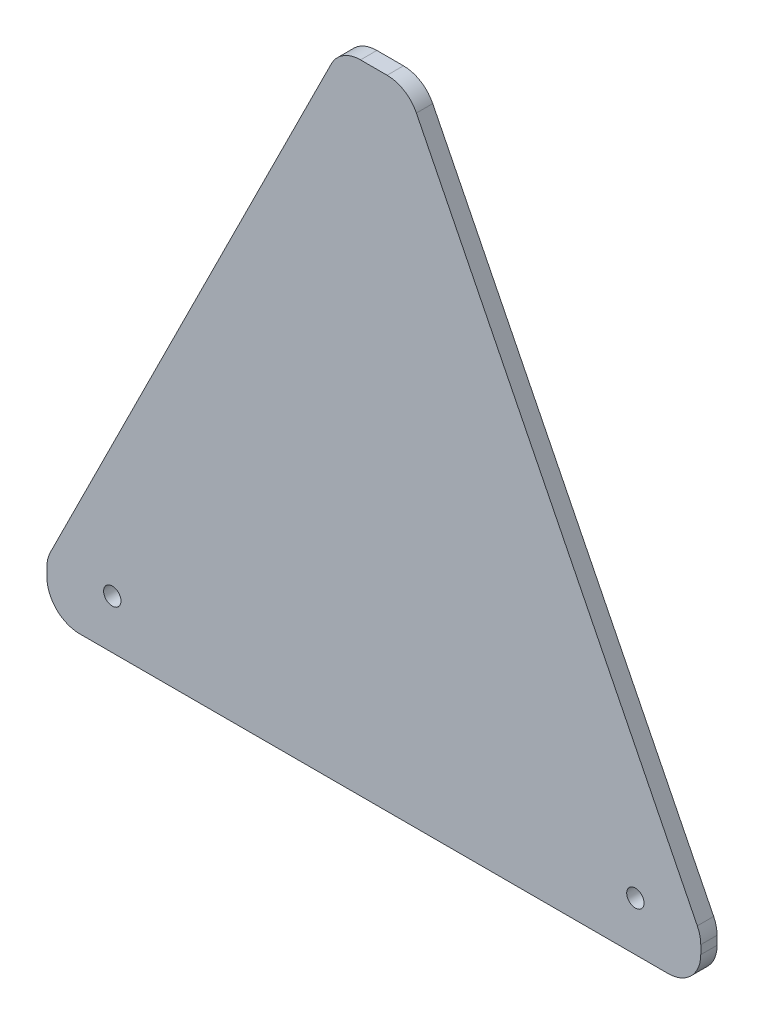
ISO-10303-21;
HEADER;
FILE_DESCRIPTION(('STEP AP214'),'2;1');
FILE_NAME('part.step','',(''),(''),'','','');
FILE_SCHEMA(('AUTOMOTIVE_DESIGN { 1 0 10303 214 1 1 1 1 }'));
ENDSEC;
DATA;
#1=APPLICATION_CONTEXT('core data for automotive mechanical design processes');
#2=APPLICATION_PROTOCOL_DEFINITION('international standard','automotive_design',2000,#1);
#3=PRODUCT_CONTEXT('',#1,'mechanical');
#4=PRODUCT('Part','Part','',(#3));
#5=PRODUCT_RELATED_PRODUCT_CATEGORY('part','',(#4));
#6=PRODUCT_DEFINITION_FORMATION('','',#4);
#7=PRODUCT_DEFINITION_CONTEXT('part definition',#1,'design');
#8=PRODUCT_DEFINITION('design','',#6,#7);
#9=PRODUCT_DEFINITION_SHAPE('','',#8);
#10=(LENGTH_UNIT() NAMED_UNIT(*) SI_UNIT(.MILLI.,.METRE.));
#11=(NAMED_UNIT(*) PLANE_ANGLE_UNIT() SI_UNIT($,.RADIAN.));
#12=(NAMED_UNIT(*) SI_UNIT($,.STERADIAN.) SOLID_ANGLE_UNIT());
#13=UNCERTAINTY_MEASURE_WITH_UNIT(LENGTH_MEASURE(1.E-05),#10,'distance_accuracy_value','');
#14=(GEOMETRIC_REPRESENTATION_CONTEXT(3) GLOBAL_UNCERTAINTY_ASSIGNED_CONTEXT((#13)) GLOBAL_UNIT_ASSIGNED_CONTEXT((#10,
#11,#12)) REPRESENTATION_CONTEXT('',''));
#15=CARTESIAN_POINT('',(0.,0.,0.));
#16=DIRECTION('',(0.,0.,1.));
#17=DIRECTION('',(1.,0.,0.));
#18=AXIS2_PLACEMENT_3D('',#15,#16,#17);
#19=CARTESIAN_POINT('',(0.,0.,6.35));
#20=DIRECTION('',(0.,0.,-1.));
#21=DIRECTION('',(-1.,0.,0.));
#22=AXIS2_PLACEMENT_3D('',#19,#20,#21);
#23=PLANE('',#22);
#24=DIRECTION('',(-1.,0.,0.));
#25=VECTOR('',#24,1.);
#26=CARTESIAN_POINT('',(113.975755601014,247.65,6.35));
#27=LINE('',#26,#25);
#28=CARTESIAN_POINT('',(132.165245934657,247.65,6.35));
#29=VERTEX_POINT('',#28);
#30=CARTESIAN_POINT('',(121.834754065343,247.65,6.35));
#31=VERTEX_POINT('',#30);
#32=EDGE_CURVE('E231',#29,#31,#27,.T.);
#33=ORIENTED_EDGE('',*,*,#32,.T.);
#34=CARTESIAN_POINT('',(121.834754065343,234.95,6.35));
#35=DIRECTION('',(0.,0.,-1.));
#36=DIRECTION('',(-1.,0.,0.));
#37=AXIS2_PLACEMENT_3D('',#34,#35,#36);
#38=CIRCLE('',#37,12.7);
#39=CARTESIAN_POINT('',(110.469087672997,240.616712226495,6.35));
#40=VERTEX_POINT('',#39);
#41=EDGE_CURVE('E182',#31,#40,#38,.F.);
#42=ORIENTED_EDGE('',*,*,#41,.T.);
#43=DIRECTION('',(-0.446197813109806,-0.894934361602026,0.));
#44=VECTOR('',#43,1.);
#45=CARTESIAN_POINT('',(0.,19.05,6.35));
#46=LINE('',#45,#44);
#47=CARTESIAN_POINT('',(1.33433360765427,21.7262591842563,6.35));
#48=VERTEX_POINT('',#47);
#49=EDGE_CURVE('E144',#40,#48,#46,.T.);
#50=ORIENTED_EDGE('',*,*,#49,.T.);
#51=CARTESIAN_POINT('',(12.7,16.0595469577618,6.35));
#52=DIRECTION('',(0.,0.,-1.));
#53=DIRECTION('',(-1.,0.,0.));
#54=AXIS2_PLACEMENT_3D('',#51,#52,#53);
#55=CIRCLE('',#54,12.7);
#56=CARTESIAN_POINT('',(0.,16.0595469577618,6.35));
#57=VERTEX_POINT('',#56);
#58=EDGE_CURVE('E173',#48,#57,#55,.F.);
#59=ORIENTED_EDGE('',*,*,#58,.T.);
#60=DIRECTION('',(0.,-1.,0.));
#61=VECTOR('',#60,1.);
#62=CARTESIAN_POINT('',(0.,0.,6.35));
#63=LINE('',#62,#61);
#64=CARTESIAN_POINT('',(0.,12.7,6.35));
#65=VERTEX_POINT('',#64);
#66=EDGE_CURVE('E151',#57,#65,#63,.T.);
#67=ORIENTED_EDGE('',*,*,#66,.T.);
#68=CARTESIAN_POINT('',(12.7,12.7,6.35));
#69=DIRECTION('',(0.,0.,-1.));
#70=DIRECTION('',(-1.,0.,0.));
#71=AXIS2_PLACEMENT_3D('',#68,#69,#70);
#72=CIRCLE('',#71,12.7);
#73=CARTESIAN_POINT('',(12.7,0.,6.35));
#74=VERTEX_POINT('',#73);
#75=EDGE_CURVE('E175',#65,#74,#72,.F.);
#76=ORIENTED_EDGE('',*,*,#75,.T.);
#77=DIRECTION('',(1.,0.,0.));
#78=VECTOR('',#77,1.);
#79=CARTESIAN_POINT('',(0.,0.,6.35));
#80=LINE('',#79,#78);
#81=CARTESIAN_POINT('',(241.3,0.,6.35));
#82=VERTEX_POINT('',#81);
#83=EDGE_CURVE('E155',#74,#82,#80,.T.);
#84=ORIENTED_EDGE('',*,*,#83,.T.);
#85=CARTESIAN_POINT('',(241.3,12.7,6.35));
#86=DIRECTION('',(0.,0.,-1.));
#87=DIRECTION('',(-1.,0.,0.));
#88=AXIS2_PLACEMENT_3D('',#85,#86,#87);
#89=CIRCLE('',#88,12.7);
#90=CARTESIAN_POINT('',(254.,12.7,6.35));
#91=VERTEX_POINT('',#90);
#92=EDGE_CURVE('E177',#82,#91,#89,.F.);
#93=ORIENTED_EDGE('',*,*,#92,.T.);
#94=DIRECTION('',(0.,1.,0.));
#95=VECTOR('',#94,1.);
#96=CARTESIAN_POINT('',(254.,0.,6.35));
#97=LINE('',#96,#95);
#98=CARTESIAN_POINT('',(254.,16.0595469577617,6.35));
#99=VERTEX_POINT('',#98);
#100=EDGE_CURVE('E235',#91,#99,#97,.T.);
#101=ORIENTED_EDGE('',*,*,#100,.T.);
#102=CARTESIAN_POINT('',(241.3,16.0595469577617,6.35));
#103=DIRECTION('',(0.,0.,-1.));
#104=DIRECTION('',(-1.,0.,0.));
#105=AXIS2_PLACEMENT_3D('',#102,#103,#104);
#106=CIRCLE('',#105,12.7);
#107=CARTESIAN_POINT('',(252.665666392346,21.7262591842563,6.35));
#108=VERTEX_POINT('',#107);
#109=EDGE_CURVE('E56',#99,#108,#106,.F.);
#110=ORIENTED_EDGE('',*,*,#109,.T.);
#111=DIRECTION('',(-0.446197813109806,0.894934361602026,0.));
#112=VECTOR('',#111,1.);
#113=CARTESIAN_POINT('',(140.024244398986,247.65,6.35));
#114=LINE('',#113,#112);
#115=CARTESIAN_POINT('',(143.530912327003,240.616712226495,6.35));
#116=VERTEX_POINT('',#115);
#117=EDGE_CURVE('E232',#108,#116,#114,.T.);
#118=ORIENTED_EDGE('',*,*,#117,.T.);
#119=CARTESIAN_POINT('',(132.165245934657,234.95,6.35));
#120=DIRECTION('',(0.,0.,-1.));
#121=DIRECTION('',(-1.,0.,0.));
#122=AXIS2_PLACEMENT_3D('',#119,#120,#121);
#123=CIRCLE('',#122,12.7);
#124=EDGE_CURVE('E180',#116,#29,#123,.F.);
#125=ORIENTED_EDGE('',*,*,#124,.T.);
#126=EDGE_LOOP('',(#33,#42,#50,#59,#67,#76,#84,#93,#101,#110,#118,#125));
#127=FACE_BOUND('',#126,.T.);
#128=CARTESIAN_POINT('',(25.4,19.05,6.35));
#129=DIRECTION('',(0.,0.,1.));
#130=DIRECTION('',(1.,0.,0.));
#131=AXIS2_PLACEMENT_3D('',#128,#129,#130);
#132=CIRCLE('',#131,3.3734375);
#133=CARTESIAN_POINT('',(28.7734375,19.05,6.35));
#134=VERTEX_POINT('',#133);
#135=EDGE_CURVE('E209',#134,#134,#132,.T.);
#136=ORIENTED_EDGE('',*,*,#135,.F.);
#137=EDGE_LOOP('',(#136));
#138=FACE_BOUND('',#137,.T.);
#139=CARTESIAN_POINT('',(228.6,19.05,6.35));
#140=DIRECTION('',(0.,0.,1.));
#141=DIRECTION('',(1.,0.,0.));
#142=AXIS2_PLACEMENT_3D('',#139,#140,#141);
#143=CIRCLE('',#142,3.37343750000003);
#144=CARTESIAN_POINT('',(231.9734375,19.05,6.35));
#145=VERTEX_POINT('',#144);
#146=EDGE_CURVE('E242',#145,#145,#143,.T.);
#147=ORIENTED_EDGE('',*,*,#146,.F.);
#148=EDGE_LOOP('',(#147));
#149=FACE_BOUND('',#148,.T.);
#150=ADVANCED_FACE('F34',(#127,#138,#149),#23,.F.);
#151=CARTESIAN_POINT('',(0.,0.,0.));
#152=DIRECTION('',(0.,0.,-1.));
#153=DIRECTION('',(-1.,0.,0.));
#154=AXIS2_PLACEMENT_3D('',#151,#152,#153);
#155=PLANE('',#154);
#156=CARTESIAN_POINT('',(25.4,19.05,0.));
#157=DIRECTION('',(0.,0.,1.));
#158=DIRECTION('',(1.,0.,0.));
#159=AXIS2_PLACEMENT_3D('',#156,#157,#158);
#160=CIRCLE('',#159,3.3734375);
#161=CARTESIAN_POINT('',(28.7734375,19.05,0.));
#162=VERTEX_POINT('',#161);
#163=EDGE_CURVE('E215',#162,#162,#160,.T.);
#164=ORIENTED_EDGE('',*,*,#163,.T.);
#165=EDGE_LOOP('',(#164));
#166=FACE_BOUND('',#165,.T.);
#167=DIRECTION('',(-0.446197813109806,-0.894934361602026,0.));
#168=VECTOR('',#167,1.);
#169=CARTESIAN_POINT('',(0.,19.05,0.));
#170=LINE('',#169,#168);
#171=CARTESIAN_POINT('',(110.469087672997,240.616712226495,0.));
#172=VERTEX_POINT('',#171);
#173=CARTESIAN_POINT('',(1.33433360765427,21.7262591842563,0.));
#174=VERTEX_POINT('',#173);
#175=EDGE_CURVE('E141',#172,#174,#170,.T.);
#176=ORIENTED_EDGE('',*,*,#175,.F.);
#177=CARTESIAN_POINT('',(121.834754065343,234.95,0.));
#178=DIRECTION('',(0.,0.,-1.));
#179=DIRECTION('',(-1.,0.,0.));
#180=AXIS2_PLACEMENT_3D('',#177,#178,#179);
#181=CIRCLE('',#180,12.7);
#182=CARTESIAN_POINT('',(121.834754065343,247.65,0.));
#183=VERTEX_POINT('',#182);
#184=EDGE_CURVE('E124',#172,#183,#181,.T.);
#185=ORIENTED_EDGE('',*,*,#184,.T.);
#186=DIRECTION('',(-1.,0.,0.));
#187=VECTOR('',#186,1.);
#188=CARTESIAN_POINT('',(113.975755601014,247.65,0.));
#189=LINE('',#188,#187);
#190=CARTESIAN_POINT('',(132.165245934657,247.65,0.));
#191=VERTEX_POINT('',#190);
#192=EDGE_CURVE('E152',#191,#183,#189,.T.);
#193=ORIENTED_EDGE('',*,*,#192,.F.);
#194=CARTESIAN_POINT('',(132.165245934657,234.95,0.));
#195=DIRECTION('',(0.,0.,-1.));
#196=DIRECTION('',(-1.,0.,0.));
#197=AXIS2_PLACEMENT_3D('',#194,#195,#196);
#198=CIRCLE('',#197,12.7);
#199=CARTESIAN_POINT('',(143.530912327003,240.616712226495,0.));
#200=VERTEX_POINT('',#199);
#201=EDGE_CURVE('E135',#191,#200,#198,.T.);
#202=ORIENTED_EDGE('',*,*,#201,.T.);
#203=DIRECTION('',(-0.446197813109806,0.894934361602026,0.));
#204=VECTOR('',#203,1.);
#205=CARTESIAN_POINT('',(140.024244398986,247.65,0.));
#206=LINE('',#205,#204);
#207=CARTESIAN_POINT('',(252.665666392346,21.7262591842563,0.));
#208=VERTEX_POINT('',#207);
#209=EDGE_CURVE('E157',#208,#200,#206,.T.);
#210=ORIENTED_EDGE('',*,*,#209,.F.);
#211=CARTESIAN_POINT('',(241.3,16.0595469577617,0.));
#212=DIRECTION('',(0.,0.,-1.));
#213=DIRECTION('',(-1.,0.,0.));
#214=AXIS2_PLACEMENT_3D('',#211,#212,#213);
#215=CIRCLE('',#214,12.7);
#216=CARTESIAN_POINT('',(254.,16.0595469577617,0.));
#217=VERTEX_POINT('',#216);
#218=EDGE_CURVE('E167',#208,#217,#215,.T.);
#219=ORIENTED_EDGE('',*,*,#218,.T.);
#220=DIRECTION('',(0.,1.,0.));
#221=VECTOR('',#220,1.);
#222=CARTESIAN_POINT('',(254.,0.,0.));
#223=LINE('',#222,#221);
#224=CARTESIAN_POINT('',(254.,12.7,0.));
#225=VERTEX_POINT('',#224);
#226=EDGE_CURVE('E212',#225,#217,#223,.T.);
#227=ORIENTED_EDGE('',*,*,#226,.F.);
#228=CARTESIAN_POINT('',(241.3,12.7,0.));
#229=DIRECTION('',(0.,0.,-1.));
#230=DIRECTION('',(-1.,0.,0.));
#231=AXIS2_PLACEMENT_3D('',#228,#229,#230);
#232=CIRCLE('',#231,12.7);
#233=CARTESIAN_POINT('',(241.3,0.,0.));
#234=VERTEX_POINT('',#233);
#235=EDGE_CURVE('E165',#225,#234,#232,.T.);
#236=ORIENTED_EDGE('',*,*,#235,.T.);
#237=DIRECTION('',(1.,0.,0.));
#238=VECTOR('',#237,1.);
#239=CARTESIAN_POINT('',(0.,0.,0.));
#240=LINE('',#239,#238);
#241=CARTESIAN_POINT('',(12.7,0.,0.));
#242=VERTEX_POINT('',#241);
#243=EDGE_CURVE('E208',#242,#234,#240,.T.);
#244=ORIENTED_EDGE('',*,*,#243,.F.);
#245=CARTESIAN_POINT('',(12.7,12.7,0.));
#246=DIRECTION('',(0.,0.,-1.));
#247=DIRECTION('',(-1.,0.,0.));
#248=AXIS2_PLACEMENT_3D('',#245,#246,#247);
#249=CIRCLE('',#248,12.7);
#250=CARTESIAN_POINT('',(0.,12.7,0.));
#251=VERTEX_POINT('',#250);
#252=EDGE_CURVE('E163',#242,#251,#249,.T.);
#253=ORIENTED_EDGE('',*,*,#252,.T.);
#254=DIRECTION('',(0.,-1.,0.));
#255=VECTOR('',#254,1.);
#256=CARTESIAN_POINT('',(0.,0.,0.));
#257=LINE('',#256,#255);
#258=CARTESIAN_POINT('',(0.,16.0595469577618,0.));
#259=VERTEX_POINT('',#258);
#260=EDGE_CURVE('E203',#259,#251,#257,.T.);
#261=ORIENTED_EDGE('',*,*,#260,.F.);
#262=CARTESIAN_POINT('',(12.7,16.0595469577618,0.));
#263=DIRECTION('',(0.,0.,-1.));
#264=DIRECTION('',(-1.,0.,0.));
#265=AXIS2_PLACEMENT_3D('',#262,#263,#264);
#266=CIRCLE('',#265,12.7);
#267=EDGE_CURVE('E145',#259,#174,#266,.T.);
#268=ORIENTED_EDGE('',*,*,#267,.T.);
#269=EDGE_LOOP('',(#176,#185,#193,#202,#210,#219,#227,#236,#244,#253,#261,#268));
#270=FACE_BOUND('',#269,.T.);
#271=CARTESIAN_POINT('',(228.6,19.05,0.));
#272=DIRECTION('',(0.,0.,1.));
#273=DIRECTION('',(1.,0.,0.));
#274=AXIS2_PLACEMENT_3D('',#271,#272,#273);
#275=CIRCLE('',#274,3.37343750000003);
#276=CARTESIAN_POINT('',(231.9734375,19.05,0.));
#277=VERTEX_POINT('',#276);
#278=EDGE_CURVE('E244',#277,#277,#275,.T.);
#279=ORIENTED_EDGE('',*,*,#278,.T.);
#280=EDGE_LOOP('',(#279));
#281=FACE_BOUND('',#280,.T.);
#282=ADVANCED_FACE('F148',(#166,#270,#281),#155,.T.);
#283=CARTESIAN_POINT('',(0.,0.,6.35));
#284=DIRECTION('',(1.,0.,0.));
#285=DIRECTION('',(0.,0.,-1.));
#286=AXIS2_PLACEMENT_3D('',#283,#284,#285);
#287=PLANE('',#286);
#288=ORIENTED_EDGE('',*,*,#260,.T.);
#289=DIRECTION('',(0.,0.,-1.));
#290=VECTOR('',#289,1.);
#291=CARTESIAN_POINT('',(0.,12.7,6.35));
#292=LINE('',#291,#290);
#293=EDGE_CURVE('E11',#251,#65,#292,.F.);
#294=ORIENTED_EDGE('',*,*,#293,.T.);
#295=ORIENTED_EDGE('',*,*,#66,.F.);
#296=DIRECTION('',(0.,0.,-1.));
#297=VECTOR('',#296,1.);
#298=CARTESIAN_POINT('',(0.,16.0595469577618,6.35));
#299=LINE('',#298,#297);
#300=EDGE_CURVE('E42',#57,#259,#299,.T.);
#301=ORIENTED_EDGE('',*,*,#300,.T.);
#302=EDGE_LOOP('',(#288,#294,#295,#301));
#303=FACE_BOUND('',#302,.T.);
#304=ADVANCED_FACE('F202',(#303),#287,.F.);
#305=CARTESIAN_POINT('',(0.,0.,6.35));
#306=DIRECTION('',(0.,1.,0.));
#307=DIRECTION('',(0.,0.,1.));
#308=AXIS2_PLACEMENT_3D('',#305,#306,#307);
#309=PLANE('',#308);
#310=ORIENTED_EDGE('',*,*,#243,.T.);
#311=DIRECTION('',(0.,0.,-1.));
#312=VECTOR('',#311,1.);
#313=CARTESIAN_POINT('',(241.3,0.,6.35));
#314=LINE('',#313,#312);
#315=EDGE_CURVE('E196',#234,#82,#314,.F.);
#316=ORIENTED_EDGE('',*,*,#315,.T.);
#317=ORIENTED_EDGE('',*,*,#83,.F.);
#318=DIRECTION('',(0.,0.,-1.));
#319=VECTOR('',#318,1.);
#320=CARTESIAN_POINT('',(12.7,0.,6.35));
#321=LINE('',#320,#319);
#322=EDGE_CURVE('E193',#74,#242,#321,.T.);
#323=ORIENTED_EDGE('',*,*,#322,.T.);
#324=EDGE_LOOP('',(#310,#316,#317,#323));
#325=FACE_BOUND('',#324,.T.);
#326=ADVANCED_FACE('F273',(#325),#309,.F.);
#327=CARTESIAN_POINT('',(254.,0.,6.35));
#328=DIRECTION('',(-1.,0.,0.));
#329=DIRECTION('',(0.,0.,1.));
#330=AXIS2_PLACEMENT_3D('',#327,#328,#329);
#331=PLANE('',#330);
#332=ORIENTED_EDGE('',*,*,#226,.T.);
#333=DIRECTION('',(0.,0.,-1.));
#334=VECTOR('',#333,1.);
#335=CARTESIAN_POINT('',(254.,16.0595469577617,6.35));
#336=LINE('',#335,#334);
#337=EDGE_CURVE('E191',#217,#99,#336,.F.);
#338=ORIENTED_EDGE('',*,*,#337,.T.);
#339=ORIENTED_EDGE('',*,*,#100,.F.);
#340=DIRECTION('',(0.,0.,-1.));
#341=VECTOR('',#340,1.);
#342=CARTESIAN_POINT('',(254.,12.7,6.35));
#343=LINE('',#342,#341);
#344=EDGE_CURVE('E188',#91,#225,#343,.T.);
#345=ORIENTED_EDGE('',*,*,#344,.T.);
#346=EDGE_LOOP('',(#332,#338,#339,#345));
#347=FACE_BOUND('',#346,.T.);
#348=ADVANCED_FACE('F270',(#347),#331,.F.);
#349=CARTESIAN_POINT('',(140.024244398986,247.65,6.35));
#350=DIRECTION('',(-0.894934361602026,-0.446197813109806,0.));
#351=DIRECTION('',(0.446197813109806,-0.894934361602026,0.));
#352=AXIS2_PLACEMENT_3D('',#349,#350,#351);
#353=PLANE('',#352);
#354=ORIENTED_EDGE('',*,*,#209,.T.);
#355=DIRECTION('',(0.,0.,-1.));
#356=VECTOR('',#355,1.);
#357=CARTESIAN_POINT('',(143.530912327003,240.616712226495,6.35));
#358=LINE('',#357,#356);
#359=EDGE_CURVE('E49',#200,#116,#358,.F.);
#360=ORIENTED_EDGE('',*,*,#359,.T.);
#361=ORIENTED_EDGE('',*,*,#117,.F.);
#362=DIRECTION('',(0.,0.,-1.));
#363=VECTOR('',#362,1.);
#364=CARTESIAN_POINT('',(252.665666392346,21.7262591842563,6.35));
#365=LINE('',#364,#363);
#366=EDGE_CURVE('E184',#108,#208,#365,.T.);
#367=ORIENTED_EDGE('',*,*,#366,.T.);
#368=EDGE_LOOP('',(#354,#360,#361,#367));
#369=FACE_BOUND('',#368,.T.);
#370=ADVANCED_FACE('F222',(#369),#353,.F.);
#371=CARTESIAN_POINT('',(113.975755601014,247.65,6.35));
#372=DIRECTION('',(0.,-1.,0.));
#373=DIRECTION('',(0.,0.,-1.));
#374=AXIS2_PLACEMENT_3D('',#371,#372,#373);
#375=PLANE('',#374);
#376=ORIENTED_EDGE('',*,*,#192,.T.);
#377=DIRECTION('',(0.,0.,-1.));
#378=VECTOR('',#377,1.);
#379=CARTESIAN_POINT('',(121.834754065343,247.65,6.35));
#380=LINE('',#379,#378);
#381=EDGE_CURVE('E129',#183,#31,#380,.F.);
#382=ORIENTED_EDGE('',*,*,#381,.T.);
#383=ORIENTED_EDGE('',*,*,#32,.F.);
#384=DIRECTION('',(0.,0.,-1.));
#385=VECTOR('',#384,1.);
#386=CARTESIAN_POINT('',(132.165245934657,247.65,6.35));
#387=LINE('',#386,#385);
#388=EDGE_CURVE('E134',#29,#191,#387,.T.);
#389=ORIENTED_EDGE('',*,*,#388,.T.);
#390=EDGE_LOOP('',(#376,#382,#383,#389));
#391=FACE_BOUND('',#390,.T.);
#392=ADVANCED_FACE('F234',(#391),#375,.F.);
#393=CARTESIAN_POINT('',(0.,19.05,6.35));
#394=DIRECTION('',(0.894934361602026,-0.446197813109806,0.));
#395=DIRECTION('',(0.446197813109806,0.894934361602026,0.));
#396=AXIS2_PLACEMENT_3D('',#393,#394,#395);
#397=PLANE('',#396);
#398=ORIENTED_EDGE('',*,*,#49,.F.);
#399=DIRECTION('',(0.,0.,-1.));
#400=VECTOR('',#399,1.);
#401=CARTESIAN_POINT('',(110.469087672997,240.616712226495,6.35));
#402=LINE('',#401,#400);
#403=EDGE_CURVE('E128',#40,#172,#402,.T.);
#404=ORIENTED_EDGE('',*,*,#403,.T.);
#405=ORIENTED_EDGE('',*,*,#175,.T.);
#406=DIRECTION('',(0.,0.,-1.));
#407=VECTOR('',#406,1.);
#408=CARTESIAN_POINT('',(1.33433360765427,21.7262591842563,6.35));
#409=LINE('',#408,#407);
#410=EDGE_CURVE('E146',#174,#48,#409,.F.);
#411=ORIENTED_EDGE('',*,*,#410,.T.);
#412=EDGE_LOOP('',(#398,#404,#405,#411));
#413=FACE_BOUND('',#412,.T.);
#414=ADVANCED_FACE('F140',(#413),#397,.F.);
#415=CARTESIAN_POINT('',(25.4,19.05,6.35));
#416=DIRECTION('',(0.,0.,-1.));
#417=DIRECTION('',(-1.,0.,0.));
#418=AXIS2_PLACEMENT_3D('',#415,#416,#417);
#419=CYLINDRICAL_SURFACE('',#418,3.3734375);
#420=ORIENTED_EDGE('',*,*,#135,.T.);
#421=EDGE_LOOP('',(#420));
#422=FACE_BOUND('',#421,.T.);
#423=ORIENTED_EDGE('',*,*,#163,.F.);
#424=EDGE_LOOP('',(#423));
#425=FACE_BOUND('',#424,.T.);
#426=ADVANCED_FACE('F261',(#422,#425),#419,.F.);
#427=CARTESIAN_POINT('',(228.6,19.05,6.35));
#428=DIRECTION('',(0.,0.,-1.));
#429=DIRECTION('',(-1.,0.,0.));
#430=AXIS2_PLACEMENT_3D('',#427,#428,#429);
#431=CYLINDRICAL_SURFACE('',#430,3.37343750000003);
#432=ORIENTED_EDGE('',*,*,#146,.T.);
#433=EDGE_LOOP('',(#432));
#434=FACE_BOUND('',#433,.T.);
#435=ORIENTED_EDGE('',*,*,#278,.F.);
#436=EDGE_LOOP('',(#435));
#437=FACE_BOUND('',#436,.T.);
#438=ADVANCED_FACE('F250',(#434,#437),#431,.F.);
#439=CARTESIAN_POINT('',(121.834754065343,234.95,6.35));
#440=DIRECTION('',(0.,0.,-1.));
#441=DIRECTION('',(-1.,0.,0.));
#442=AXIS2_PLACEMENT_3D('',#439,#440,#441);
#443=CYLINDRICAL_SURFACE('',#442,12.7);
#444=ORIENTED_EDGE('',*,*,#41,.F.);
#445=ORIENTED_EDGE('',*,*,#381,.F.);
#446=ORIENTED_EDGE('',*,*,#184,.F.);
#447=ORIENTED_EDGE('',*,*,#403,.F.);
#448=EDGE_LOOP('',(#444,#445,#446,#447));
#449=FACE_BOUND('',#448,.T.);
#450=ADVANCED_FACE('F127',(#449),#443,.T.);
#451=CARTESIAN_POINT('',(132.165245934657,234.95,6.35));
#452=DIRECTION('',(0.,0.,-1.));
#453=DIRECTION('',(-1.,0.,0.));
#454=AXIS2_PLACEMENT_3D('',#451,#452,#453);
#455=CYLINDRICAL_SURFACE('',#454,12.7);
#456=ORIENTED_EDGE('',*,*,#124,.F.);
#457=ORIENTED_EDGE('',*,*,#359,.F.);
#458=ORIENTED_EDGE('',*,*,#201,.F.);
#459=ORIENTED_EDGE('',*,*,#388,.F.);
#460=EDGE_LOOP('',(#456,#457,#458,#459));
#461=FACE_BOUND('',#460,.T.);
#462=ADVANCED_FACE('F226',(#461),#455,.T.);
#463=CARTESIAN_POINT('',(241.3,16.0595469577617,6.35));
#464=DIRECTION('',(0.,0.,-1.));
#465=DIRECTION('',(-1.,0.,0.));
#466=AXIS2_PLACEMENT_3D('',#463,#464,#465);
#467=CYLINDRICAL_SURFACE('',#466,12.7);
#468=ORIENTED_EDGE('',*,*,#109,.F.);
#469=ORIENTED_EDGE('',*,*,#337,.F.);
#470=ORIENTED_EDGE('',*,*,#218,.F.);
#471=ORIENTED_EDGE('',*,*,#366,.F.);
#472=EDGE_LOOP('',(#468,#469,#470,#471));
#473=FACE_BOUND('',#472,.T.);
#474=ADVANCED_FACE('F284',(#473),#467,.T.);
#475=CARTESIAN_POINT('',(241.3,12.7,6.35));
#476=DIRECTION('',(0.,0.,-1.));
#477=DIRECTION('',(-1.,0.,0.));
#478=AXIS2_PLACEMENT_3D('',#475,#476,#477);
#479=CYLINDRICAL_SURFACE('',#478,12.7);
#480=ORIENTED_EDGE('',*,*,#92,.F.);
#481=ORIENTED_EDGE('',*,*,#315,.F.);
#482=ORIENTED_EDGE('',*,*,#235,.F.);
#483=ORIENTED_EDGE('',*,*,#344,.F.);
#484=EDGE_LOOP('',(#480,#481,#482,#483));
#485=FACE_BOUND('',#484,.T.);
#486=ADVANCED_FACE('F287',(#485),#479,.T.);
#487=CARTESIAN_POINT('',(12.7,12.7,6.35));
#488=DIRECTION('',(0.,0.,-1.));
#489=DIRECTION('',(-1.,0.,0.));
#490=AXIS2_PLACEMENT_3D('',#487,#488,#489);
#491=CYLINDRICAL_SURFACE('',#490,12.7);
#492=ORIENTED_EDGE('',*,*,#75,.F.);
#493=ORIENTED_EDGE('',*,*,#293,.F.);
#494=ORIENTED_EDGE('',*,*,#252,.F.);
#495=ORIENTED_EDGE('',*,*,#322,.F.);
#496=EDGE_LOOP('',(#492,#493,#494,#495));
#497=FACE_BOUND('',#496,.T.);
#498=ADVANCED_FACE('F290',(#497),#491,.T.);
#499=CARTESIAN_POINT('',(12.7,16.0595469577618,6.35));
#500=DIRECTION('',(0.,0.,-1.));
#501=DIRECTION('',(-1.,0.,0.));
#502=AXIS2_PLACEMENT_3D('',#499,#500,#501);
#503=CYLINDRICAL_SURFACE('',#502,12.7);
#504=ORIENTED_EDGE('',*,*,#58,.F.);
#505=ORIENTED_EDGE('',*,*,#410,.F.);
#506=ORIENTED_EDGE('',*,*,#267,.F.);
#507=ORIENTED_EDGE('',*,*,#300,.F.);
#508=EDGE_LOOP('',(#504,#505,#506,#507));
#509=FACE_BOUND('',#508,.T.);
#510=ADVANCED_FACE('F36',(#509),#503,.T.);
#511=CLOSED_SHELL('',(#150,#282,#304,#326,#348,#370,#392,#414,#426,#438,#450,#462,#474,#486,
#498,#510));
#512=MANIFOLD_SOLID_BREP('B2',#511);
#513=ADVANCED_BREP_SHAPE_REPRESENTATION('',(#18,#512),#14);
#514=SHAPE_DEFINITION_REPRESENTATION(#9,#513);
ENDSEC;
END-ISO-10303-21;
